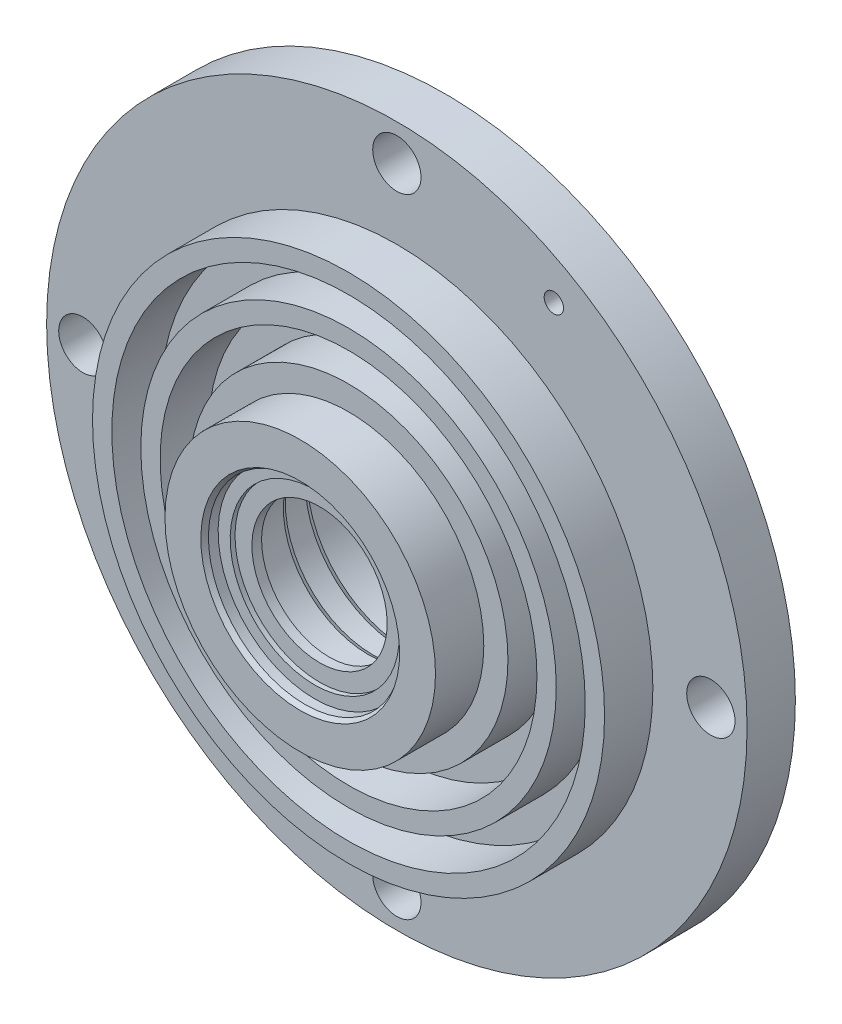
ISO-10303-21;
HEADER;
FILE_DESCRIPTION(('STEP AP214'),'2;1');
FILE_NAME('part.step','',(''),(''),'','','');
FILE_SCHEMA(('AUTOMOTIVE_DESIGN { 1 0 10303 214 1 1 1 1 }'));
ENDSEC;
DATA;
#1=APPLICATION_CONTEXT('core data for automotive mechanical design processes');
#2=APPLICATION_PROTOCOL_DEFINITION('international standard','automotive_design',2000,#1);
#3=PRODUCT_CONTEXT('',#1,'mechanical');
#4=PRODUCT('Part','Part','',(#3));
#5=PRODUCT_RELATED_PRODUCT_CATEGORY('part','',(#4));
#6=PRODUCT_DEFINITION_FORMATION('','',#4);
#7=PRODUCT_DEFINITION_CONTEXT('part definition',#1,'design');
#8=PRODUCT_DEFINITION('design','',#6,#7);
#9=PRODUCT_DEFINITION_SHAPE('','',#8);
#10=(LENGTH_UNIT() NAMED_UNIT(*) SI_UNIT(.MILLI.,.METRE.));
#11=(NAMED_UNIT(*) PLANE_ANGLE_UNIT() SI_UNIT($,.RADIAN.));
#12=(NAMED_UNIT(*) SI_UNIT($,.STERADIAN.) SOLID_ANGLE_UNIT());
#13=UNCERTAINTY_MEASURE_WITH_UNIT(LENGTH_MEASURE(1.E-05),#10,'distance_accuracy_value','');
#14=(GEOMETRIC_REPRESENTATION_CONTEXT(3) GLOBAL_UNCERTAINTY_ASSIGNED_CONTEXT((#13)) GLOBAL_UNIT_ASSIGNED_CONTEXT((#10,
#11,#12)) REPRESENTATION_CONTEXT('',''));
#15=CARTESIAN_POINT('',(0.,0.,0.));
#16=DIRECTION('',(0.,0.,1.));
#17=DIRECTION('',(1.,0.,0.));
#18=AXIS2_PLACEMENT_3D('',#15,#16,#17);
#19=CARTESIAN_POINT('',(0.,0.,-30.));
#20=DIRECTION('',(0.,0.,1.));
#21=DIRECTION('',(1.,0.,0.));
#22=AXIS2_PLACEMENT_3D('',#19,#20,#21);
#23=PLANE('',#22);
#24=CARTESIAN_POINT('',(0.,0.,-30.));
#25=DIRECTION('',(0.,0.,1.));
#26=DIRECTION('',(1.,0.,0.));
#27=AXIS2_PLACEMENT_3D('',#24,#25,#26);
#28=CIRCLE('',#27,72.5);
#29=CARTESIAN_POINT('',(72.5,0.,-30.));
#30=VERTEX_POINT('',#29);
#31=EDGE_CURVE('E10',#30,#30,#28,.T.);
#32=ORIENTED_EDGE('',*,*,#31,.F.);
#33=EDGE_LOOP('',(#32));
#34=FACE_BOUND('',#33,.T.);
#35=CARTESIAN_POINT('',(0.,-65.,-30.));
#36=DIRECTION('',(0.,0.,1.));
#37=DIRECTION('',(1.,0.,0.));
#38=AXIS2_PLACEMENT_3D('',#35,#36,#37);
#39=CIRCLE('',#38,5.);
#40=CARTESIAN_POINT('',(5.,-65.,-30.));
#41=VERTEX_POINT('',#40);
#42=EDGE_CURVE('E37',#41,#41,#39,.T.);
#43=ORIENTED_EDGE('',*,*,#42,.T.);
#44=EDGE_LOOP('',(#43));
#45=FACE_BOUND('',#44,.T.);
#46=CARTESIAN_POINT('',(32.5000000000001,56.2916512459885,-30.));
#47=DIRECTION('',(0.,0.,1.));
#48=DIRECTION('',(1.,0.,0.));
#49=AXIS2_PLACEMENT_3D('',#46,#47,#48);
#50=CIRCLE('',#49,2.);
#51=CARTESIAN_POINT('',(34.5000000000001,56.2916512459885,-30.));
#52=VERTEX_POINT('',#51);
#53=EDGE_CURVE('E41',#52,#52,#50,.T.);
#54=ORIENTED_EDGE('',*,*,#53,.T.);
#55=EDGE_LOOP('',(#54));
#56=FACE_BOUND('',#55,.T.);
#57=CARTESIAN_POINT('',(65.,0.,-30.));
#58=DIRECTION('',(0.,0.,1.));
#59=DIRECTION('',(1.,0.,0.));
#60=AXIS2_PLACEMENT_3D('',#57,#58,#59);
#61=CIRCLE('',#60,5.);
#62=CARTESIAN_POINT('',(70.,0.,-30.));
#63=VERTEX_POINT('',#62);
#64=EDGE_CURVE('E46',#63,#63,#61,.T.);
#65=ORIENTED_EDGE('',*,*,#64,.T.);
#66=EDGE_LOOP('',(#65));
#67=FACE_BOUND('',#66,.T.);
#68=CARTESIAN_POINT('',(0.,65.,-30.));
#69=DIRECTION('',(0.,0.,1.));
#70=DIRECTION('',(1.,0.,0.));
#71=AXIS2_PLACEMENT_3D('',#68,#69,#70);
#72=CIRCLE('',#71,5.);
#73=CARTESIAN_POINT('',(5.,65.,-30.));
#74=VERTEX_POINT('',#73);
#75=EDGE_CURVE('E49',#74,#74,#72,.T.);
#76=ORIENTED_EDGE('',*,*,#75,.T.);
#77=EDGE_LOOP('',(#76));
#78=FACE_BOUND('',#77,.T.);
#79=CARTESIAN_POINT('',(-65.,0.,-30.));
#80=DIRECTION('',(0.,0.,1.));
#81=DIRECTION('',(1.,0.,0.));
#82=AXIS2_PLACEMENT_3D('',#79,#80,#81);
#83=CIRCLE('',#82,5.);
#84=CARTESIAN_POINT('',(-60.,0.,-30.));
#85=VERTEX_POINT('',#84);
#86=EDGE_CURVE('E52',#85,#85,#83,.T.);
#87=ORIENTED_EDGE('',*,*,#86,.T.);
#88=EDGE_LOOP('',(#87));
#89=FACE_BOUND('',#88,.T.);
#90=CARTESIAN_POINT('',(-32.5000000000001,-56.2916512459885,-30.));
#91=DIRECTION('',(0.,0.,1.));
#92=DIRECTION('',(1.,0.,0.));
#93=AXIS2_PLACEMENT_3D('',#90,#91,#92);
#94=CIRCLE('',#93,2.);
#95=CARTESIAN_POINT('',(-30.5000000000001,-56.2916512459885,-30.));
#96=VERTEX_POINT('',#95);
#97=EDGE_CURVE('E55',#96,#96,#94,.T.);
#98=ORIENTED_EDGE('',*,*,#97,.T.);
#99=EDGE_LOOP('',(#98));
#100=FACE_BOUND('',#99,.T.);
#101=CARTESIAN_POINT('',(0.,-2.5,-30.));
#102=DIRECTION('',(0.,0.,1.));
#103=DIRECTION('',(0.,-1.,0.));
#104=AXIS2_PLACEMENT_3D('',#101,#102,#103);
#105=CIRCLE('',#104,21.);
#106=CARTESIAN_POINT('',(0.,-23.5,-30.));
#107=VERTEX_POINT('',#106);
#108=EDGE_CURVE('E58',#107,#107,#105,.T.);
#109=ORIENTED_EDGE('',*,*,#108,.T.);
#110=EDGE_LOOP('',(#109));
#111=FACE_BOUND('',#110,.T.);
#112=ADVANCED_FACE('F29',(#34,#45,#56,#67,#78,#89,#100,#111),#23,.F.);
#113=CARTESIAN_POINT('',(0.,0.,0.));
#114=DIRECTION('',(0.,0.,1.));
#115=DIRECTION('',(1.,0.,0.));
#116=AXIS2_PLACEMENT_3D('',#113,#114,#115);
#117=PLANE('',#116);
#118=CARTESIAN_POINT('',(0.,-2.5,0.));
#119=DIRECTION('',(0.,0.,1.));
#120=DIRECTION('',(1.,0.,0.));
#121=AXIS2_PLACEMENT_3D('',#118,#119,#120);
#122=CIRCLE('',#121,28.);
#123=CARTESIAN_POINT('',(28.,-2.5,0.));
#124=VERTEX_POINT('',#123);
#125=EDGE_CURVE('E130',#124,#124,#122,.T.);
#126=ORIENTED_EDGE('',*,*,#125,.T.);
#127=EDGE_LOOP('',(#126));
#128=FACE_BOUND('',#127,.T.);
#129=CARTESIAN_POINT('',(0.,-2.5,0.));
#130=DIRECTION('',(0.,0.,1.));
#131=DIRECTION('',(0.,-1.,0.));
#132=AXIS2_PLACEMENT_3D('',#129,#130,#131);
#133=CIRCLE('',#132,20.5773502691896);
#134=CARTESIAN_POINT('',(0.,-23.0773502691896,0.));
#135=VERTEX_POINT('',#134);
#136=EDGE_CURVE('E100',#135,#135,#133,.T.);
#137=ORIENTED_EDGE('',*,*,#136,.F.);
#138=EDGE_LOOP('',(#137));
#139=FACE_BOUND('',#138,.T.);
#140=ADVANCED_FACE('F224',(#128,#139),#117,.T.);
#141=CARTESIAN_POINT('',(0.,0.,-30.));
#142=DIRECTION('',(0.,0.,1.));
#143=DIRECTION('',(1.,0.,0.));
#144=AXIS2_PLACEMENT_3D('',#141,#142,#143);
#145=CYLINDRICAL_SURFACE('',#144,72.5);
#146=CARTESIAN_POINT('',(0.,0.,-20.));
#147=DIRECTION('',(0.,0.,-1.));
#148=DIRECTION('',(-1.,0.,0.));
#149=AXIS2_PLACEMENT_3D('',#146,#147,#148);
#150=CIRCLE('',#149,72.5);
#151=CARTESIAN_POINT('',(-72.5,0.,-20.));
#152=VERTEX_POINT('',#151);
#153=EDGE_CURVE('E103',#152,#152,#150,.F.);
#154=ORIENTED_EDGE('',*,*,#153,.F.);
#155=EDGE_LOOP('',(#154));
#156=FACE_BOUND('',#155,.T.);
#157=ORIENTED_EDGE('',*,*,#31,.T.);
#158=EDGE_LOOP('',(#157));
#159=FACE_BOUND('',#158,.T.);
#160=ADVANCED_FACE('F31',(#156,#159),#145,.T.);
#161=CARTESIAN_POINT('',(0.,-65.,-30.));
#162=DIRECTION('',(0.,0.,1.));
#163=DIRECTION('',(1.,0.,0.));
#164=AXIS2_PLACEMENT_3D('',#161,#162,#163);
#165=CYLINDRICAL_SURFACE('',#164,5.);
#166=CARTESIAN_POINT('',(0.,-65.,-20.));
#167=DIRECTION('',(0.,0.,-1.));
#168=DIRECTION('',(-1.,0.,0.));
#169=AXIS2_PLACEMENT_3D('',#166,#167,#168);
#170=CIRCLE('',#169,5.);
#171=CARTESIAN_POINT('',(-5.,-65.,-20.));
#172=VERTEX_POINT('',#171);
#173=EDGE_CURVE('E106',#172,#172,#170,.F.);
#174=ORIENTED_EDGE('',*,*,#173,.T.);
#175=EDGE_LOOP('',(#174));
#176=FACE_BOUND('',#175,.T.);
#177=ORIENTED_EDGE('',*,*,#42,.F.);
#178=EDGE_LOOP('',(#177));
#179=FACE_BOUND('',#178,.T.);
#180=ADVANCED_FACE('F215',(#176,#179),#165,.F.);
#181=CARTESIAN_POINT('',(32.5000000000001,56.2916512459885,-30.));
#182=DIRECTION('',(0.,0.,1.));
#183=DIRECTION('',(1.,0.,0.));
#184=AXIS2_PLACEMENT_3D('',#181,#182,#183);
#185=CYLINDRICAL_SURFACE('',#184,2.);
#186=CARTESIAN_POINT('',(32.5000000000001,56.2916512459885,-20.));
#187=DIRECTION('',(0.,0.,-1.));
#188=DIRECTION('',(-1.,0.,0.));
#189=AXIS2_PLACEMENT_3D('',#186,#187,#188);
#190=CIRCLE('',#189,2.);
#191=CARTESIAN_POINT('',(30.5000000000001,56.2916512459885,-20.));
#192=VERTEX_POINT('',#191);
#193=EDGE_CURVE('E109',#192,#192,#190,.F.);
#194=ORIENTED_EDGE('',*,*,#193,.T.);
#195=EDGE_LOOP('',(#194));
#196=FACE_BOUND('',#195,.T.);
#197=ORIENTED_EDGE('',*,*,#53,.F.);
#198=EDGE_LOOP('',(#197));
#199=FACE_BOUND('',#198,.T.);
#200=ADVANCED_FACE('F218',(#196,#199),#185,.F.);
#201=CARTESIAN_POINT('',(65.,0.,-30.));
#202=DIRECTION('',(0.,0.,1.));
#203=DIRECTION('',(1.,0.,0.));
#204=AXIS2_PLACEMENT_3D('',#201,#202,#203);
#205=CYLINDRICAL_SURFACE('',#204,5.);
#206=CARTESIAN_POINT('',(65.,0.,-20.));
#207=DIRECTION('',(0.,0.,-1.));
#208=DIRECTION('',(-1.,0.,0.));
#209=AXIS2_PLACEMENT_3D('',#206,#207,#208);
#210=CIRCLE('',#209,5.);
#211=CARTESIAN_POINT('',(60.,0.,-20.));
#212=VERTEX_POINT('',#211);
#213=EDGE_CURVE('E112',#212,#212,#210,.F.);
#214=ORIENTED_EDGE('',*,*,#213,.T.);
#215=EDGE_LOOP('',(#214));
#216=FACE_BOUND('',#215,.T.);
#217=ORIENTED_EDGE('',*,*,#64,.F.);
#218=EDGE_LOOP('',(#217));
#219=FACE_BOUND('',#218,.T.);
#220=ADVANCED_FACE('F263',(#216,#219),#205,.F.);
#221=CARTESIAN_POINT('',(0.,65.,-30.));
#222=DIRECTION('',(0.,0.,1.));
#223=DIRECTION('',(1.,0.,0.));
#224=AXIS2_PLACEMENT_3D('',#221,#222,#223);
#225=CYLINDRICAL_SURFACE('',#224,5.);
#226=CARTESIAN_POINT('',(0.,65.,-20.));
#227=DIRECTION('',(0.,0.,-1.));
#228=DIRECTION('',(-1.,0.,0.));
#229=AXIS2_PLACEMENT_3D('',#226,#227,#228);
#230=CIRCLE('',#229,5.);
#231=CARTESIAN_POINT('',(-5.,65.,-20.));
#232=VERTEX_POINT('',#231);
#233=EDGE_CURVE('E115',#232,#232,#230,.F.);
#234=ORIENTED_EDGE('',*,*,#233,.T.);
#235=EDGE_LOOP('',(#234));
#236=FACE_BOUND('',#235,.T.);
#237=ORIENTED_EDGE('',*,*,#75,.F.);
#238=EDGE_LOOP('',(#237));
#239=FACE_BOUND('',#238,.T.);
#240=ADVANCED_FACE('F259',(#236,#239),#225,.F.);
#241=CARTESIAN_POINT('',(-65.,0.,-30.));
#242=DIRECTION('',(0.,0.,1.));
#243=DIRECTION('',(1.,0.,0.));
#244=AXIS2_PLACEMENT_3D('',#241,#242,#243);
#245=CYLINDRICAL_SURFACE('',#244,5.);
#246=CARTESIAN_POINT('',(-65.,0.,-20.));
#247=DIRECTION('',(0.,0.,-1.));
#248=DIRECTION('',(-1.,0.,0.));
#249=AXIS2_PLACEMENT_3D('',#246,#247,#248);
#250=CIRCLE('',#249,5.);
#251=CARTESIAN_POINT('',(-70.,0.,-20.));
#252=VERTEX_POINT('',#251);
#253=EDGE_CURVE('E118',#252,#252,#250,.F.);
#254=ORIENTED_EDGE('',*,*,#253,.T.);
#255=EDGE_LOOP('',(#254));
#256=FACE_BOUND('',#255,.T.);
#257=ORIENTED_EDGE('',*,*,#86,.F.);
#258=EDGE_LOOP('',(#257));
#259=FACE_BOUND('',#258,.T.);
#260=ADVANCED_FACE('F252',(#256,#259),#245,.F.);
#261=CARTESIAN_POINT('',(-32.5000000000001,-56.2916512459885,-30.));
#262=DIRECTION('',(0.,0.,1.));
#263=DIRECTION('',(1.,0.,0.));
#264=AXIS2_PLACEMENT_3D('',#261,#262,#263);
#265=CYLINDRICAL_SURFACE('',#264,2.);
#266=CARTESIAN_POINT('',(-32.5000000000001,-56.2916512459885,-20.));
#267=DIRECTION('',(0.,0.,-1.));
#268=DIRECTION('',(-1.,0.,0.));
#269=AXIS2_PLACEMENT_3D('',#266,#267,#268);
#270=CIRCLE('',#269,2.);
#271=CARTESIAN_POINT('',(-34.5000000000001,-56.2916512459885,-20.));
#272=VERTEX_POINT('',#271);
#273=EDGE_CURVE('E33',#272,#272,#270,.F.);
#274=ORIENTED_EDGE('',*,*,#273,.T.);
#275=EDGE_LOOP('',(#274));
#276=FACE_BOUND('',#275,.T.);
#277=ORIENTED_EDGE('',*,*,#97,.F.);
#278=EDGE_LOOP('',(#277));
#279=FACE_BOUND('',#278,.T.);
#280=ADVANCED_FACE('F242',(#276,#279),#265,.F.);
#281=CARTESIAN_POINT('',(0.,-2.5,0.));
#282=DIRECTION('',(0.,0.,1.));
#283=DIRECTION('',(0.,-1.,0.));
#284=AXIS2_PLACEMENT_3D('',#281,#282,#283);
#285=CYLINDRICAL_SURFACE('',#284,21.);
#286=CARTESIAN_POINT('',(0.,-2.5,-22.));
#287=DIRECTION('',(0.,0.,1.));
#288=DIRECTION('',(0.,-1.,0.));
#289=AXIS2_PLACEMENT_3D('',#286,#287,#288);
#290=CIRCLE('',#289,21.);
#291=CARTESIAN_POINT('',(0.,-23.5,-22.));
#292=VERTEX_POINT('',#291);
#293=EDGE_CURVE('E61',#292,#292,#290,.T.);
#294=ORIENTED_EDGE('',*,*,#293,.T.);
#295=EDGE_LOOP('',(#294));
#296=FACE_BOUND('',#295,.T.);
#297=ORIENTED_EDGE('',*,*,#108,.F.);
#298=EDGE_LOOP('',(#297));
#299=FACE_BOUND('',#298,.T.);
#300=ADVANCED_FACE('F239',(#296,#299),#285,.F.);
#301=CARTESIAN_POINT('',(0.,18.0773502691896,-22.));
#302=DIRECTION('',(0.,0.,-1.));
#303=DIRECTION('',(0.,1.,0.));
#304=AXIS2_PLACEMENT_3D('',#301,#302,#303);
#305=PLANE('',#304);
#306=CARTESIAN_POINT('',(0.,-2.5,-22.));
#307=DIRECTION('',(0.,0.,1.));
#308=DIRECTION('',(0.,-1.,0.));
#309=AXIS2_PLACEMENT_3D('',#306,#307,#308);
#310=CIRCLE('',#309,20.5773502691896);
#311=CARTESIAN_POINT('',(0.,-23.0773502691896,-22.));
#312=VERTEX_POINT('',#311);
#313=EDGE_CURVE('E64',#312,#312,#310,.T.);
#314=ORIENTED_EDGE('',*,*,#313,.T.);
#315=EDGE_LOOP('',(#314));
#316=FACE_BOUND('',#315,.T.);
#317=ORIENTED_EDGE('',*,*,#293,.F.);
#318=EDGE_LOOP('',(#317));
#319=FACE_BOUND('',#318,.T.);
#320=ADVANCED_FACE('F241',(#316,#319),#305,.T.);
#321=CARTESIAN_POINT('',(0.,-2.5,-22.));
#322=DIRECTION('',(0.,0.,-1.));
#323=DIRECTION('',(0.,1.,0.));
#324=AXIS2_PLACEMENT_3D('',#321,#322,#323);
#325=CONICAL_SURFACE('',#324,20.5773502691896,0.523598775598299);
#326=CARTESIAN_POINT('',(0.,-2.5,-21.));
#327=DIRECTION('',(0.,0.,1.));
#328=DIRECTION('',(0.,-1.,0.));
#329=AXIS2_PLACEMENT_3D('',#326,#327,#328);
#330=CIRCLE('',#329,20.);
#331=CARTESIAN_POINT('',(0.,-22.5,-21.));
#332=VERTEX_POINT('',#331);
#333=EDGE_CURVE('E67',#332,#332,#330,.T.);
#334=ORIENTED_EDGE('',*,*,#333,.T.);
#335=EDGE_LOOP('',(#334));
#336=FACE_BOUND('',#335,.T.);
#337=ORIENTED_EDGE('',*,*,#313,.F.);
#338=EDGE_LOOP('',(#337));
#339=FACE_BOUND('',#338,.T.);
#340=ADVANCED_FACE('F249',(#336,#339),#325,.F.);
#341=CARTESIAN_POINT('',(0.,-2.5,0.));
#342=DIRECTION('',(0.,0.,1.));
#343=DIRECTION('',(0.,-1.,0.));
#344=AXIS2_PLACEMENT_3D('',#341,#342,#343);
#345=CYLINDRICAL_SURFACE('',#344,20.);
#346=CARTESIAN_POINT('',(0.,-2.5,-15.));
#347=DIRECTION('',(0.,0.,1.));
#348=DIRECTION('',(0.,-1.,0.));
#349=AXIS2_PLACEMENT_3D('',#346,#347,#348);
#350=CIRCLE('',#349,20.);
#351=CARTESIAN_POINT('',(0.,-22.5,-15.));
#352=VERTEX_POINT('',#351);
#353=EDGE_CURVE('E70',#352,#352,#350,.T.);
#354=ORIENTED_EDGE('',*,*,#353,.T.);
#355=EDGE_LOOP('',(#354));
#356=FACE_BOUND('',#355,.T.);
#357=ORIENTED_EDGE('',*,*,#333,.F.);
#358=EDGE_LOOP('',(#357));
#359=FACE_BOUND('',#358,.T.);
#360=ADVANCED_FACE('F336',(#356,#359),#345,.F.);
#361=CARTESIAN_POINT('',(0.,15.5773502691896,-15.));
#362=DIRECTION('',(0.,0.,-1.));
#363=DIRECTION('',(0.,1.,0.));
#364=AXIS2_PLACEMENT_3D('',#361,#362,#363);
#365=PLANE('',#364);
#366=CARTESIAN_POINT('',(0.,-2.5,-15.));
#367=DIRECTION('',(0.,0.,1.));
#368=DIRECTION('',(0.,-1.,0.));
#369=AXIS2_PLACEMENT_3D('',#366,#367,#368);
#370=CIRCLE('',#369,18.0773502691896);
#371=CARTESIAN_POINT('',(0.,-20.5773502691896,-15.));
#372=VERTEX_POINT('',#371);
#373=EDGE_CURVE('E73',#372,#372,#370,.T.);
#374=ORIENTED_EDGE('',*,*,#373,.T.);
#375=EDGE_LOOP('',(#374));
#376=FACE_BOUND('',#375,.T.);
#377=ORIENTED_EDGE('',*,*,#353,.F.);
#378=EDGE_LOOP('',(#377));
#379=FACE_BOUND('',#378,.T.);
#380=ADVANCED_FACE('F330',(#376,#379),#365,.T.);
#381=CARTESIAN_POINT('',(0.,-2.5,-15.));
#382=DIRECTION('',(0.,0.,-1.));
#383=DIRECTION('',(0.,1.,0.));
#384=AXIS2_PLACEMENT_3D('',#381,#382,#383);
#385=CONICAL_SURFACE('',#384,18.0773502691896,0.523598775598299);
#386=CARTESIAN_POINT('',(0.,-2.5,-14.));
#387=DIRECTION('',(0.,0.,1.));
#388=DIRECTION('',(0.,-1.,0.));
#389=AXIS2_PLACEMENT_3D('',#386,#387,#388);
#390=CIRCLE('',#389,17.5);
#391=CARTESIAN_POINT('',(0.,-20.,-14.));
#392=VERTEX_POINT('',#391);
#393=EDGE_CURVE('E76',#392,#392,#390,.T.);
#394=ORIENTED_EDGE('',*,*,#393,.T.);
#395=EDGE_LOOP('',(#394));
#396=FACE_BOUND('',#395,.T.);
#397=ORIENTED_EDGE('',*,*,#373,.F.);
#398=EDGE_LOOP('',(#397));
#399=FACE_BOUND('',#398,.T.);
#400=ADVANCED_FACE('F324',(#396,#399),#385,.F.);
#401=CARTESIAN_POINT('',(0.,-2.5,0.));
#402=DIRECTION('',(0.,0.,1.));
#403=DIRECTION('',(0.,-1.,0.));
#404=AXIS2_PLACEMENT_3D('',#401,#402,#403);
#405=CYLINDRICAL_SURFACE('',#404,17.5);
#406=CARTESIAN_POINT('',(0.,-2.5,-6.));
#407=DIRECTION('',(0.,0.,1.));
#408=DIRECTION('',(0.,-1.,0.));
#409=AXIS2_PLACEMENT_3D('',#406,#407,#408);
#410=CIRCLE('',#409,17.5);
#411=CARTESIAN_POINT('',(0.,-20.,-6.));
#412=VERTEX_POINT('',#411);
#413=EDGE_CURVE('E79',#412,#412,#410,.T.);
#414=ORIENTED_EDGE('',*,*,#413,.T.);
#415=EDGE_LOOP('',(#414));
#416=FACE_BOUND('',#415,.T.);
#417=ORIENTED_EDGE('',*,*,#393,.F.);
#418=EDGE_LOOP('',(#417));
#419=FACE_BOUND('',#418,.T.);
#420=ADVANCED_FACE('F318',(#416,#419),#405,.F.);
#421=CARTESIAN_POINT('',(0.,11.5,-6.));
#422=DIRECTION('',(0.,0.,-1.));
#423=DIRECTION('',(0.,1.,0.));
#424=AXIS2_PLACEMENT_3D('',#421,#422,#423);
#425=PLANE('',#424);
#426=CARTESIAN_POINT('',(0.,-2.5,-6.));
#427=DIRECTION('',(0.,0.,1.));
#428=DIRECTION('',(0.,-1.,0.));
#429=AXIS2_PLACEMENT_3D('',#426,#427,#428);
#430=CIRCLE('',#429,14.);
#431=CARTESIAN_POINT('',(0.,-16.5,-6.));
#432=VERTEX_POINT('',#431);
#433=EDGE_CURVE('E82',#432,#432,#430,.T.);
#434=ORIENTED_EDGE('',*,*,#433,.T.);
#435=EDGE_LOOP('',(#434));
#436=FACE_BOUND('',#435,.T.);
#437=ORIENTED_EDGE('',*,*,#413,.F.);
#438=EDGE_LOOP('',(#437));
#439=FACE_BOUND('',#438,.T.);
#440=ADVANCED_FACE('F312',(#436,#439),#425,.T.);
#441=CARTESIAN_POINT('',(0.,-2.5,0.));
#442=DIRECTION('',(0.,0.,1.));
#443=DIRECTION('',(0.,-1.,0.));
#444=AXIS2_PLACEMENT_3D('',#441,#442,#443);
#445=CYLINDRICAL_SURFACE('',#444,14.);
#446=CARTESIAN_POINT('',(0.,-2.5,-4.));
#447=DIRECTION('',(0.,0.,1.));
#448=DIRECTION('',(0.,-1.,0.));
#449=AXIS2_PLACEMENT_3D('',#446,#447,#448);
#450=CIRCLE('',#449,14.);
#451=CARTESIAN_POINT('',(0.,-16.5,-4.));
#452=VERTEX_POINT('',#451);
#453=EDGE_CURVE('E85',#452,#452,#450,.T.);
#454=ORIENTED_EDGE('',*,*,#453,.T.);
#455=EDGE_LOOP('',(#454));
#456=FACE_BOUND('',#455,.T.);
#457=ORIENTED_EDGE('',*,*,#433,.F.);
#458=EDGE_LOOP('',(#457));
#459=FACE_BOUND('',#458,.T.);
#460=ADVANCED_FACE('F306',(#456,#459),#445,.F.);
#461=CARTESIAN_POINT('',(0.,15.,-4.));
#462=DIRECTION('',(0.,0.,1.));
#463=DIRECTION('',(0.,-1.,0.));
#464=AXIS2_PLACEMENT_3D('',#461,#462,#463);
#465=PLANE('',#464);
#466=CARTESIAN_POINT('',(0.,-2.5,-4.));
#467=DIRECTION('',(0.,0.,1.));
#468=DIRECTION('',(0.,-1.,0.));
#469=AXIS2_PLACEMENT_3D('',#466,#467,#468);
#470=CIRCLE('',#469,17.5);
#471=CARTESIAN_POINT('',(0.,-20.,-4.));
#472=VERTEX_POINT('',#471);
#473=EDGE_CURVE('E88',#472,#472,#470,.T.);
#474=ORIENTED_EDGE('',*,*,#473,.T.);
#475=EDGE_LOOP('',(#474));
#476=FACE_BOUND('',#475,.T.);
#477=ORIENTED_EDGE('',*,*,#453,.F.);
#478=EDGE_LOOP('',(#477));
#479=FACE_BOUND('',#478,.T.);
#480=ADVANCED_FACE('F300',(#476,#479),#465,.T.);
#481=CARTESIAN_POINT('',(0.,-2.5,0.));
#482=DIRECTION('',(0.,0.,1.));
#483=DIRECTION('',(0.,-1.,0.));
#484=AXIS2_PLACEMENT_3D('',#481,#482,#483);
#485=CYLINDRICAL_SURFACE('',#484,17.5);
#486=CARTESIAN_POINT('',(0.,-2.5,-3.));
#487=DIRECTION('',(0.,0.,1.));
#488=DIRECTION('',(0.,-1.,0.));
#489=AXIS2_PLACEMENT_3D('',#486,#487,#488);
#490=CIRCLE('',#489,17.5);
#491=CARTESIAN_POINT('',(0.,-20.,-3.));
#492=VERTEX_POINT('',#491);
#493=EDGE_CURVE('E91',#492,#492,#490,.T.);
#494=ORIENTED_EDGE('',*,*,#493,.T.);
#495=EDGE_LOOP('',(#494));
#496=FACE_BOUND('',#495,.T.);
#497=ORIENTED_EDGE('',*,*,#473,.F.);
#498=EDGE_LOOP('',(#497));
#499=FACE_BOUND('',#498,.T.);
#500=ADVANCED_FACE('F294',(#496,#499),#485,.F.);
#501=CARTESIAN_POINT('',(0.,17.5,-3.));
#502=DIRECTION('',(0.,0.,1.));
#503=DIRECTION('',(0.,-1.,0.));
#504=AXIS2_PLACEMENT_3D('',#501,#502,#503);
#505=PLANE('',#504);
#506=CARTESIAN_POINT('',(0.,-2.5,-3.));
#507=DIRECTION('',(0.,0.,1.));
#508=DIRECTION('',(0.,-1.,0.));
#509=AXIS2_PLACEMENT_3D('',#506,#507,#508);
#510=CIRCLE('',#509,20.);
#511=CARTESIAN_POINT('',(0.,-22.5,-3.));
#512=VERTEX_POINT('',#511);
#513=EDGE_CURVE('E94',#512,#512,#510,.T.);
#514=ORIENTED_EDGE('',*,*,#513,.T.);
#515=EDGE_LOOP('',(#514));
#516=FACE_BOUND('',#515,.T.);
#517=ORIENTED_EDGE('',*,*,#493,.F.);
#518=EDGE_LOOP('',(#517));
#519=FACE_BOUND('',#518,.T.);
#520=ADVANCED_FACE('F288',(#516,#519),#505,.T.);
#521=CARTESIAN_POINT('',(0.,-2.5,0.));
#522=DIRECTION('',(0.,0.,1.));
#523=DIRECTION('',(0.,-1.,0.));
#524=AXIS2_PLACEMENT_3D('',#521,#522,#523);
#525=CYLINDRICAL_SURFACE('',#524,20.);
#526=CARTESIAN_POINT('',(0.,-2.5,-0.999999999999997));
#527=DIRECTION('',(0.,0.,1.));
#528=DIRECTION('',(0.,-1.,0.));
#529=AXIS2_PLACEMENT_3D('',#526,#527,#528);
#530=CIRCLE('',#529,20.);
#531=CARTESIAN_POINT('',(0.,-22.5,-0.999999999999999));
#532=VERTEX_POINT('',#531);
#533=EDGE_CURVE('E97',#532,#532,#530,.T.);
#534=ORIENTED_EDGE('',*,*,#533,.T.);
#535=EDGE_LOOP('',(#534));
#536=FACE_BOUND('',#535,.T.);
#537=ORIENTED_EDGE('',*,*,#513,.F.);
#538=EDGE_LOOP('',(#537));
#539=FACE_BOUND('',#538,.T.);
#540=ADVANCED_FACE('F282',(#536,#539),#525,.F.);
#541=CARTESIAN_POINT('',(0.,-2.5,-0.999999999999997));
#542=DIRECTION('',(0.,0.,1.));
#543=DIRECTION('',(0.,-1.,0.));
#544=AXIS2_PLACEMENT_3D('',#541,#542,#543);
#545=CONICAL_SURFACE('',#544,20.,0.523598775598296);
#546=ORIENTED_EDGE('',*,*,#136,.T.);
#547=EDGE_LOOP('',(#546));
#548=FACE_BOUND('',#547,.T.);
#549=ORIENTED_EDGE('',*,*,#533,.F.);
#550=EDGE_LOOP('',(#549));
#551=FACE_BOUND('',#550,.T.);
#552=ADVANCED_FACE('F206',(#548,#551),#545,.F.);
#553=CARTESIAN_POINT('',(0.,-55.5,-20.));
#554=DIRECTION('',(0.,0.,-1.));
#555=DIRECTION('',(-1.,0.,0.));
#556=AXIS2_PLACEMENT_3D('',#553,#554,#555);
#557=PLANE('',#556);
#558=ORIENTED_EDGE('',*,*,#153,.T.);
#559=EDGE_LOOP('',(#558));
#560=FACE_BOUND('',#559,.T.);
#561=ORIENTED_EDGE('',*,*,#193,.F.);
#562=EDGE_LOOP('',(#561));
#563=FACE_BOUND('',#562,.T.);
#564=ORIENTED_EDGE('',*,*,#233,.F.);
#565=EDGE_LOOP('',(#564));
#566=FACE_BOUND('',#565,.T.);
#567=ORIENTED_EDGE('',*,*,#273,.F.);
#568=EDGE_LOOP('',(#567));
#569=FACE_BOUND('',#568,.T.);
#570=CARTESIAN_POINT('',(0.,-2.5,-20.));
#571=DIRECTION('',(0.,0.,1.));
#572=DIRECTION('',(1.,0.,0.));
#573=AXIS2_PLACEMENT_3D('',#570,#571,#572);
#574=CIRCLE('',#573,53.);
#575=CARTESIAN_POINT('',(53.,-2.5,-20.));
#576=VERTEX_POINT('',#575);
#577=EDGE_CURVE('E133',#576,#576,#574,.T.);
#578=ORIENTED_EDGE('',*,*,#577,.F.);
#579=EDGE_LOOP('',(#578));
#580=FACE_BOUND('',#579,.T.);
#581=ORIENTED_EDGE('',*,*,#253,.F.);
#582=EDGE_LOOP('',(#581));
#583=FACE_BOUND('',#582,.T.);
#584=ORIENTED_EDGE('',*,*,#213,.F.);
#585=EDGE_LOOP('',(#584));
#586=FACE_BOUND('',#585,.T.);
#587=ORIENTED_EDGE('',*,*,#173,.F.);
#588=EDGE_LOOP('',(#587));
#589=FACE_BOUND('',#588,.T.);
#590=ADVANCED_FACE('F203',(#560,#563,#566,#569,#580,#583,#586,#589),#557,.F.);
#591=CARTESIAN_POINT('',(0.,-35.5,-20.));
#592=DIRECTION('',(0.,0.,-1.));
#593=DIRECTION('',(-1.,0.,0.));
#594=AXIS2_PLACEMENT_3D('',#591,#592,#593);
#595=PLANE('',#594);
#596=CARTESIAN_POINT('',(0.,-2.5,-20.));
#597=DIRECTION('',(0.,0.,1.));
#598=DIRECTION('',(1.,0.,0.));
#599=AXIS2_PLACEMENT_3D('',#596,#597,#598);
#600=CIRCLE('',#599,33.);
#601=CARTESIAN_POINT('',(33.,-2.5,-20.));
#602=VERTEX_POINT('',#601);
#603=EDGE_CURVE('E121',#602,#602,#600,.T.);
#604=ORIENTED_EDGE('',*,*,#603,.F.);
#605=EDGE_LOOP('',(#604));
#606=FACE_BOUND('',#605,.T.);
#607=CARTESIAN_POINT('',(0.,-2.5,-20.));
#608=DIRECTION('',(0.,0.,1.));
#609=DIRECTION('',(1.,0.,0.));
#610=AXIS2_PLACEMENT_3D('',#607,#608,#609);
#611=CIRCLE('',#610,39.);
#612=CARTESIAN_POINT('',(39.,-2.5,-20.));
#613=VERTEX_POINT('',#612);
#614=EDGE_CURVE('E154',#613,#613,#611,.T.);
#615=ORIENTED_EDGE('',*,*,#614,.T.);
#616=EDGE_LOOP('',(#615));
#617=FACE_BOUND('',#616,.T.);
#618=ADVANCED_FACE('F158',(#606,#617),#595,.F.);
#619=CARTESIAN_POINT('',(0.,-2.5,12.6020174232004));
#620=DIRECTION('',(0.,0.,1.));
#621=DIRECTION('',(1.,0.,0.));
#622=AXIS2_PLACEMENT_3D('',#619,#620,#621);
#623=CYLINDRICAL_SURFACE('',#622,33.);
#624=CARTESIAN_POINT('',(0.,-2.5,-10.));
#625=DIRECTION('',(0.,0.,1.));
#626=DIRECTION('',(1.,0.,0.));
#627=AXIS2_PLACEMENT_3D('',#624,#625,#626);
#628=CIRCLE('',#627,33.);
#629=CARTESIAN_POINT('',(33.,-2.5,-10.));
#630=VERTEX_POINT('',#629);
#631=EDGE_CURVE('E124',#630,#630,#628,.T.);
#632=ORIENTED_EDGE('',*,*,#631,.F.);
#633=EDGE_LOOP('',(#632));
#634=FACE_BOUND('',#633,.T.);
#635=ORIENTED_EDGE('',*,*,#603,.T.);
#636=EDGE_LOOP('',(#635));
#637=FACE_BOUND('',#636,.T.);
#638=ADVANCED_FACE('F355',(#634,#637),#623,.T.);
#639=CARTESIAN_POINT('',(0.,-35.5,-10.));
#640=DIRECTION('',(0.,0.,-1.));
#641=DIRECTION('',(-1.,0.,0.));
#642=AXIS2_PLACEMENT_3D('',#639,#640,#641);
#643=PLANE('',#642);
#644=CARTESIAN_POINT('',(0.,-2.5,-10.));
#645=DIRECTION('',(0.,0.,1.));
#646=DIRECTION('',(1.,0.,0.));
#647=AXIS2_PLACEMENT_3D('',#644,#645,#646);
#648=CIRCLE('',#647,28.);
#649=CARTESIAN_POINT('',(28.,-2.5,-10.));
#650=VERTEX_POINT('',#649);
#651=EDGE_CURVE('E127',#650,#650,#648,.T.);
#652=ORIENTED_EDGE('',*,*,#651,.F.);
#653=EDGE_LOOP('',(#652));
#654=FACE_BOUND('',#653,.T.);
#655=ORIENTED_EDGE('',*,*,#631,.T.);
#656=EDGE_LOOP('',(#655));
#657=FACE_BOUND('',#656,.T.);
#658=ADVANCED_FACE('F359',(#654,#657),#643,.F.);
#659=CARTESIAN_POINT('',(0.,-2.5,12.6020174232004));
#660=DIRECTION('',(0.,0.,1.));
#661=DIRECTION('',(1.,0.,0.));
#662=AXIS2_PLACEMENT_3D('',#659,#660,#661);
#663=CYLINDRICAL_SURFACE('',#662,28.);
#664=ORIENTED_EDGE('',*,*,#125,.F.);
#665=EDGE_LOOP('',(#664));
#666=FACE_BOUND('',#665,.T.);
#667=ORIENTED_EDGE('',*,*,#651,.T.);
#668=EDGE_LOOP('',(#667));
#669=FACE_BOUND('',#668,.T.);
#670=ADVANCED_FACE('F199',(#666,#669),#663,.T.);
#671=CARTESIAN_POINT('',(0.,-2.5,12.6020174232004));
#672=DIRECTION('',(0.,0.,1.));
#673=DIRECTION('',(1.,0.,0.));
#674=AXIS2_PLACEMENT_3D('',#671,#672,#673);
#675=CYLINDRICAL_SURFACE('',#674,53.);
#676=CARTESIAN_POINT('',(0.,-2.5,-10.));
#677=DIRECTION('',(0.,0.,1.));
#678=DIRECTION('',(1.,0.,0.));
#679=AXIS2_PLACEMENT_3D('',#676,#677,#678);
#680=CIRCLE('',#679,53.);
#681=CARTESIAN_POINT('',(53.,-2.5,-10.));
#682=VERTEX_POINT('',#681);
#683=EDGE_CURVE('E136',#682,#682,#680,.T.);
#684=ORIENTED_EDGE('',*,*,#683,.F.);
#685=EDGE_LOOP('',(#684));
#686=FACE_BOUND('',#685,.T.);
#687=ORIENTED_EDGE('',*,*,#577,.T.);
#688=EDGE_LOOP('',(#687));
#689=FACE_BOUND('',#688,.T.);
#690=ADVANCED_FACE('F193',(#686,#689),#675,.T.);
#691=CARTESIAN_POINT('',(0.,-51.5,-10.));
#692=DIRECTION('',(0.,0.,-1.));
#693=DIRECTION('',(-1.,0.,0.));
#694=AXIS2_PLACEMENT_3D('',#691,#692,#693);
#695=PLANE('',#694);
#696=CARTESIAN_POINT('',(0.,-2.5,-10.));
#697=DIRECTION('',(0.,0.,1.));
#698=DIRECTION('',(1.,0.,0.));
#699=AXIS2_PLACEMENT_3D('',#696,#697,#698);
#700=CIRCLE('',#699,49.);
#701=CARTESIAN_POINT('',(49.,-2.5,-10.));
#702=VERTEX_POINT('',#701);
#703=EDGE_CURVE('E139',#702,#702,#700,.T.);
#704=ORIENTED_EDGE('',*,*,#703,.F.);
#705=EDGE_LOOP('',(#704));
#706=FACE_BOUND('',#705,.T.);
#707=ORIENTED_EDGE('',*,*,#683,.T.);
#708=EDGE_LOOP('',(#707));
#709=FACE_BOUND('',#708,.T.);
#710=ADVANCED_FACE('F187',(#706,#709),#695,.F.);
#711=CARTESIAN_POINT('',(0.,-2.5,12.6020174232004));
#712=DIRECTION('',(0.,0.,1.));
#713=DIRECTION('',(1.,0.,0.));
#714=AXIS2_PLACEMENT_3D('',#711,#712,#713);
#715=CYLINDRICAL_SURFACE('',#714,49.);
#716=CARTESIAN_POINT('',(0.,-2.5,-20.));
#717=DIRECTION('',(0.,0.,1.));
#718=DIRECTION('',(1.,0.,0.));
#719=AXIS2_PLACEMENT_3D('',#716,#717,#718);
#720=CIRCLE('',#719,49.);
#721=CARTESIAN_POINT('',(49.,-2.5,-20.));
#722=VERTEX_POINT('',#721);
#723=EDGE_CURVE('E142',#722,#722,#720,.T.);
#724=ORIENTED_EDGE('',*,*,#723,.F.);
#725=EDGE_LOOP('',(#724));
#726=FACE_BOUND('',#725,.T.);
#727=ORIENTED_EDGE('',*,*,#703,.T.);
#728=EDGE_LOOP('',(#727));
#729=FACE_BOUND('',#728,.T.);
#730=ADVANCED_FACE('F181',(#726,#729),#715,.F.);
#731=CARTESIAN_POINT('',(0.,-45.5,-20.));
#732=DIRECTION('',(0.,0.,-1.));
#733=DIRECTION('',(-1.,0.,0.));
#734=AXIS2_PLACEMENT_3D('',#731,#732,#733);
#735=PLANE('',#734);
#736=CARTESIAN_POINT('',(0.,-2.5,-20.));
#737=DIRECTION('',(0.,0.,1.));
#738=DIRECTION('',(1.,0.,0.));
#739=AXIS2_PLACEMENT_3D('',#736,#737,#738);
#740=CIRCLE('',#739,43.);
#741=CARTESIAN_POINT('',(43.,-2.5,-20.));
#742=VERTEX_POINT('',#741);
#743=EDGE_CURVE('E145',#742,#742,#740,.T.);
#744=ORIENTED_EDGE('',*,*,#743,.F.);
#745=EDGE_LOOP('',(#744));
#746=FACE_BOUND('',#745,.T.);
#747=ORIENTED_EDGE('',*,*,#723,.T.);
#748=EDGE_LOOP('',(#747));
#749=FACE_BOUND('',#748,.T.);
#750=ADVANCED_FACE('F175',(#746,#749),#735,.F.);
#751=CARTESIAN_POINT('',(0.,-2.5,12.6020174232004));
#752=DIRECTION('',(0.,0.,1.));
#753=DIRECTION('',(1.,0.,0.));
#754=AXIS2_PLACEMENT_3D('',#751,#752,#753);
#755=CYLINDRICAL_SURFACE('',#754,43.);
#756=CARTESIAN_POINT('',(0.,-2.5,-10.));
#757=DIRECTION('',(0.,0.,1.));
#758=DIRECTION('',(1.,0.,0.));
#759=AXIS2_PLACEMENT_3D('',#756,#757,#758);
#760=CIRCLE('',#759,43.);
#761=CARTESIAN_POINT('',(43.,-2.5,-10.));
#762=VERTEX_POINT('',#761);
#763=EDGE_CURVE('E148',#762,#762,#760,.T.);
#764=ORIENTED_EDGE('',*,*,#763,.F.);
#765=EDGE_LOOP('',(#764));
#766=FACE_BOUND('',#765,.T.);
#767=ORIENTED_EDGE('',*,*,#743,.T.);
#768=EDGE_LOOP('',(#767));
#769=FACE_BOUND('',#768,.T.);
#770=ADVANCED_FACE('F169',(#766,#769),#755,.T.);
#771=CARTESIAN_POINT('',(0.,-41.5,-10.));
#772=DIRECTION('',(0.,0.,-1.));
#773=DIRECTION('',(-1.,0.,0.));
#774=AXIS2_PLACEMENT_3D('',#771,#772,#773);
#775=PLANE('',#774);
#776=CARTESIAN_POINT('',(0.,-2.5,-10.));
#777=DIRECTION('',(0.,0.,1.));
#778=DIRECTION('',(1.,0.,0.));
#779=AXIS2_PLACEMENT_3D('',#776,#777,#778);
#780=CIRCLE('',#779,39.);
#781=CARTESIAN_POINT('',(39.,-2.5,-10.));
#782=VERTEX_POINT('',#781);
#783=EDGE_CURVE('E151',#782,#782,#780,.T.);
#784=ORIENTED_EDGE('',*,*,#783,.F.);
#785=EDGE_LOOP('',(#784));
#786=FACE_BOUND('',#785,.T.);
#787=ORIENTED_EDGE('',*,*,#763,.T.);
#788=EDGE_LOOP('',(#787));
#789=FACE_BOUND('',#788,.T.);
#790=ADVANCED_FACE('F163',(#786,#789),#775,.F.);
#791=CARTESIAN_POINT('',(0.,-2.5,12.6020174232004));
#792=DIRECTION('',(0.,0.,1.));
#793=DIRECTION('',(1.,0.,0.));
#794=AXIS2_PLACEMENT_3D('',#791,#792,#793);
#795=CYLINDRICAL_SURFACE('',#794,39.);
#796=ORIENTED_EDGE('',*,*,#614,.F.);
#797=EDGE_LOOP('',(#796));
#798=FACE_BOUND('',#797,.T.);
#799=ORIENTED_EDGE('',*,*,#783,.T.);
#800=EDGE_LOOP('',(#799));
#801=FACE_BOUND('',#800,.T.);
#802=ADVANCED_FACE('F160',(#798,#801),#795,.F.);
#803=CLOSED_SHELL('',(#112,#140,#160,#180,#200,#220,#240,#260,#280,#300,#320,#340,#360,#380,
#400,#420,#440,#460,#480,#500,#520,#540,#552,#590,#618,#638,#658,#670,#690,#710,#730,#750,#770,
#790,#802));
#804=MANIFOLD_SOLID_BREP('B2',#803);
#805=ADVANCED_BREP_SHAPE_REPRESENTATION('',(#18,#804),#14);
#806=SHAPE_DEFINITION_REPRESENTATION(#9,#805);
ENDSEC;
END-ISO-10303-21;
